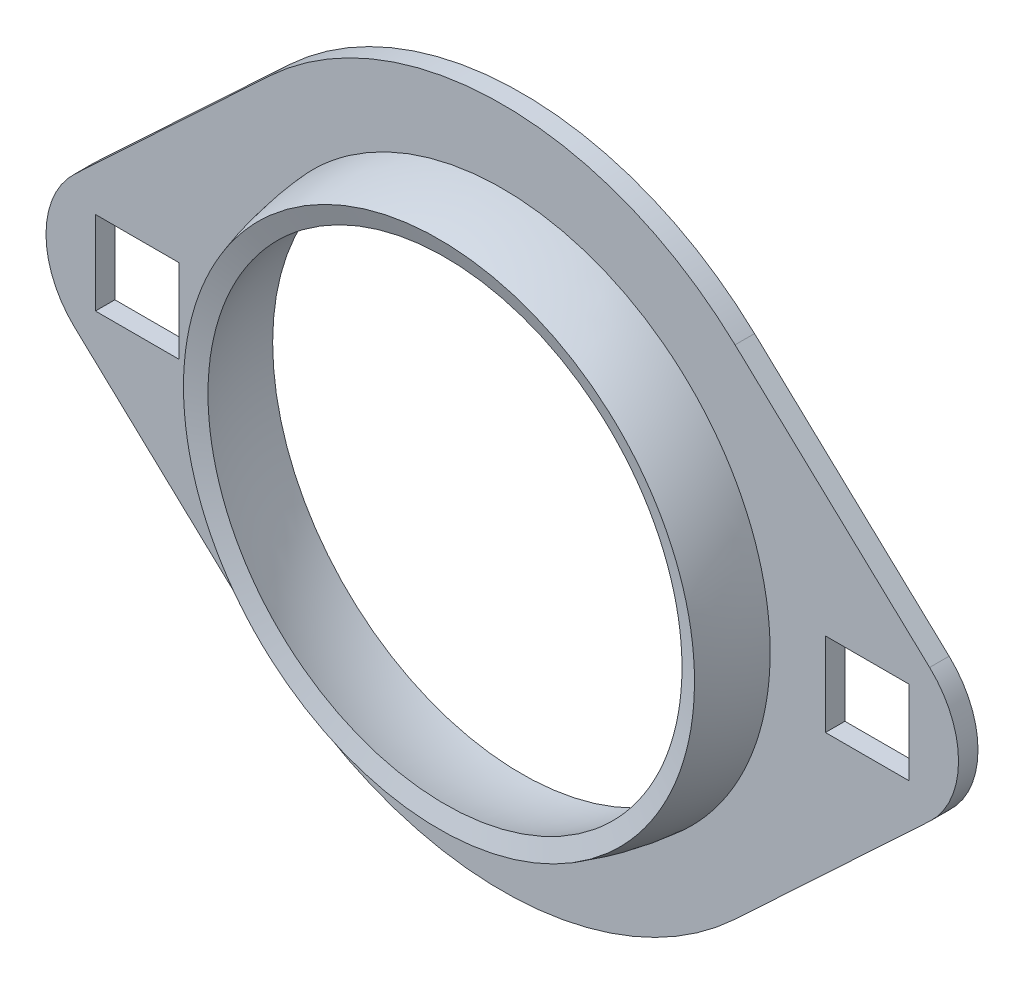
ISO-10303-21;
HEADER;
FILE_DESCRIPTION(('STEP AP214'),'2;1');
FILE_NAME('part.step','',(''),(''),'','','');
FILE_SCHEMA(('AUTOMOTIVE_DESIGN { 1 0 10303 214 1 1 1 1 }'));
ENDSEC;
DATA;
#1=APPLICATION_CONTEXT('core data for automotive mechanical design processes');
#2=APPLICATION_PROTOCOL_DEFINITION('international standard','automotive_design',2000,#1);
#3=PRODUCT_CONTEXT('',#1,'mechanical');
#4=PRODUCT('Part','Part','',(#3));
#5=PRODUCT_RELATED_PRODUCT_CATEGORY('part','',(#4));
#6=PRODUCT_DEFINITION_FORMATION('','',#4);
#7=PRODUCT_DEFINITION_CONTEXT('part definition',#1,'design');
#8=PRODUCT_DEFINITION('design','',#6,#7);
#9=PRODUCT_DEFINITION_SHAPE('','',#8);
#10=(LENGTH_UNIT() NAMED_UNIT(*) SI_UNIT(.MILLI.,.METRE.));
#11=(NAMED_UNIT(*) PLANE_ANGLE_UNIT() SI_UNIT($,.RADIAN.));
#12=(NAMED_UNIT(*) SI_UNIT($,.STERADIAN.) SOLID_ANGLE_UNIT());
#13=UNCERTAINTY_MEASURE_WITH_UNIT(LENGTH_MEASURE(1.E-05),#10,'distance_accuracy_value','');
#14=(GEOMETRIC_REPRESENTATION_CONTEXT(3) GLOBAL_UNCERTAINTY_ASSIGNED_CONTEXT((#13)) GLOBAL_UNIT_ASSIGNED_CONTEXT((#10,
#11,#12)) REPRESENTATION_CONTEXT('',''));
#15=CARTESIAN_POINT('',(0.,0.,0.));
#16=DIRECTION('',(0.,0.,1.));
#17=DIRECTION('',(1.,0.,0.));
#18=AXIS2_PLACEMENT_3D('',#15,#16,#17);
#19=CARTESIAN_POINT('',(0.,0.,0.));
#20=DIRECTION('',(1.,0.,0.));
#21=DIRECTION('',(0.,1.,0.));
#22=AXIS2_PLACEMENT_3D('',#19,#20,#21);
#23=SPHERICAL_SURFACE('',#22,28.032);
#24=CARTESIAN_POINT('',(-27.9582545950208,0.,2.03200000000001));
#25=CARTESIAN_POINT('',(-27.958252331193,0.680182055472307,2.03200000000001));
#26=CARTESIAN_POINT('',(-27.9334185683645,1.36042712634298,2.032));
#27=CARTESIAN_POINT('',(-27.8341925101078,2.71750797823654,2.032));
#28=CARTESIAN_POINT('',(-27.7597821350271,3.39434242470842,2.032));
#29=CARTESIAN_POINT('',(-27.5607902216159,4.74754433870443,2.032));
#30=CARTESIAN_POINT('',(-27.4357130096459,5.4238390488282,2.032));
#31=CARTESIAN_POINT('',(-27.13602700155,6.76554945846446,2.032));
#32=CARTESIAN_POINT('',(-26.9614052572961,7.4309622659218,2.032));
#33=CARTESIAN_POINT('',(-26.563346580858,8.74794194822464,2.032));
#34=CARTESIAN_POINT('',(-26.3398472163877,9.39948993451674,2.032));
#35=CARTESIAN_POINT('',(-25.8453385008513,10.6843939440971,2.032));
#36=CARTESIAN_POINT('',(-25.5743271307147,11.3177491929349,2.032));
#37=CARTESIAN_POINT('',(-25.1125123878,12.295538954752,2.032));
#38=CARTESIAN_POINT('',(-24.9371758249838,12.6473590727802,2.032));
#39=CARTESIAN_POINT('',(-24.5718706128582,13.3432223138298,2.032));
#40=CARTESIAN_POINT('',(-24.3819048747235,13.6872669666168,2.032));
#41=CARTESIAN_POINT('',(-23.7904258771436,14.7070403321417,2.032));
#42=CARTESIAN_POINT('',(-23.3673265732286,15.3704174716313,2.032));
#43=CARTESIAN_POINT('',(-22.4667878061652,16.6590995257827,2.032));
#44=CARTESIAN_POINT('',(-21.989346790472,17.2844033519046,2.032));
#45=CARTESIAN_POINT('',(-20.9834818620275,18.4925724510988,2.032));
#46=CARTESIAN_POINT('',(-20.4550593573339,19.0754388954696,2.032));
#47=CARTESIAN_POINT('',(-19.3510018760383,20.194568604964,2.032));
#48=CARTESIAN_POINT('',(-18.7753676018932,20.7308325632346,2.032));
#49=CARTESIAN_POINT('',(-17.5809638767955,21.7529662477435,2.032));
#50=CARTESIAN_POINT('',(-16.9621941394752,22.2388356393694,2.032));
#51=CARTESIAN_POINT('',(-15.6859371680936,23.1567095401246,2.032));
#52=CARTESIAN_POINT('',(-15.0284507772519,23.5887152217268,2.032));
#53=CARTESIAN_POINT('',(-13.6794232593485,24.3958027845922,2.032));
#54=CARTESIAN_POINT('',(-12.9878821850403,24.7708847540311,2.032));
#55=CARTESIAN_POINT('',(-11.5756552263939,25.4614616956135,2.032));
#56=CARTESIAN_POINT('',(-10.8549691128082,25.7769561989465,2.032));
#57=CARTESIAN_POINT('',(-9.38958052212397,26.3461117276332,2.032));
#58=CARTESIAN_POINT('',(-8.64487803666707,26.5997727314671,2.032));
#59=CARTESIAN_POINT('',(-7.13674787364124,27.0434587488147,2.032));
#60=CARTESIAN_POINT('',(-6.37332011084736,27.2334834726407,2.032));
#61=CARTESIAN_POINT('',(-4.83317024910259,27.548544363251,2.032));
#62=CARTESIAN_POINT('',(-4.05644815103736,27.6735805343648,2.032));
#63=CARTESIAN_POINT('',(-2.4952330573971,27.8577752328326,2.032));
#64=CARTESIAN_POINT('',(-1.71074007608846,27.9169338811072,2.032));
#65=CARTESIAN_POINT('',(-0.139559083395231,27.968953362637,2.032));
#66=CARTESIAN_POINT('',(0.647128928008367,27.9618141953182,2.032));
#67=CARTESIAN_POINT('',(2.21710632729636,27.881288838288,2.032));
#68=CARTESIAN_POINT('',(3.0003957184686,27.8079027126788,2.032));
#69=CARTESIAN_POINT('',(4.55800793071663,27.5954052596441,2.032));
#70=CARTESIAN_POINT('',(5.33233075180186,27.456293932288,2.032));
#71=CARTESIAN_POINT('',(6.86650521023924,27.113334994169,2.032));
#72=CARTESIAN_POINT('',(7.6263568409619,26.9094873537501,2.032));
#73=CARTESIAN_POINT('',(9.12618646427876,26.4385050433974,2.032));
#74=CARTESIAN_POINT('',(9.8661644568677,26.1713703734469,2.032));
#75=CARTESIAN_POINT('',(11.3209860389779,25.5757131567986,2.032));
#76=CARTESIAN_POINT('',(12.0358296272851,25.2471906071357,2.032));
#77=CARTESIAN_POINT('',(13.4353002534133,24.5310932383392,2.032));
#78=CARTESIAN_POINT('',(14.1199272912361,24.1435184192089,2.032));
#79=CARTESIAN_POINT('',(15.4540973915761,23.3120720213326,2.032));
#80=CARTESIAN_POINT('',(16.1036404612665,22.868200454097,2.032));
#81=CARTESIAN_POINT('',(17.3630249158375,21.9273161579147,2.032));
#82=CARTESIAN_POINT('',(17.9728663007207,21.4303034289715,2.032));
#83=CARTESIAN_POINT('',(19.1485119922824,20.386670082362,2.032));
#84=CARTESIAN_POINT('',(19.7143162830944,19.8400494468222,2.032));
#85=CARTESIAN_POINT('',(20.79786501225,18.7010865859055,2.032));
#86=CARTESIAN_POINT('',(21.3156094505583,18.1087443604951,2.032));
#87=CARTESIAN_POINT('',(22.2993577748703,16.8825493270035,2.032));
#88=CARTESIAN_POINT('',(22.765361644613,16.2486965058765,2.032));
#89=CARTESIAN_POINT('',(23.6423156328547,14.9439867661744,2.032));
#90=CARTESIAN_POINT('',(24.0532657513805,14.2731298476173,2.032));
#91=CARTESIAN_POINT('',(24.8171902473135,12.899181988135,2.032));
#92=CARTESIAN_POINT('',(25.1701646820331,12.1960910790758,2.032));
#93=CARTESIAN_POINT('',(25.8156288686723,10.7626731734906,2.032));
#94=CARTESIAN_POINT('',(26.1081186206675,10.0323461769987,2.032));
#95=CARTESIAN_POINT('',(26.6305339199583,8.54964855443802,2.032));
#96=CARTESIAN_POINT('',(26.860459490552,7.79727793657817,2.032));
#97=CARTESIAN_POINT('',(27.2561119412073,6.27584170589516,2.032));
#98=CARTESIAN_POINT('',(27.4218388211978,5.50677609305351,2.032));
#99=CARTESIAN_POINT('',(27.6879159039949,3.95741611492121,2.032));
#100=CARTESIAN_POINT('',(27.7882659934673,3.17712173016729,2.032));
#101=CARTESIAN_POINT('',(27.9228756074547,1.61085294834626,2.032));
#102=CARTESIAN_POINT('',(27.9571351319368,0.824878551276318,2.032));
#103=CARTESIAN_POINT('',(27.9593200490487,-0.747161160408127,2.032));
#104=CARTESIAN_POINT('',(27.9272455494152,-1.5332264748729,2.032));
#105=CARTESIAN_POINT('',(27.7969906660873,-3.09986085421447,2.032));
#106=CARTESIAN_POINT('',(27.6988102823404,-3.88042991908692,2.032));
#107=CARTESIAN_POINT('',(27.4370414333297,-5.430523609161,2.032));
#108=CARTESIAN_POINT('',(27.2734528686066,-6.20004821756664,2.032));
#109=CARTESIAN_POINT('',(26.882030681245,-7.72258089771999,2.032));
#110=CARTESIAN_POINT('',(26.6541970596767,-8.47558896974277,2.032));
#111=CARTESIAN_POINT('',(26.1359002263523,-9.9597474397663,2.032));
#112=CARTESIAN_POINT('',(25.8454359782243,-10.6908974758461,2.032));
#113=CARTESIAN_POINT('',(25.2039451473927,-12.1261287697356,2.032));
#114=CARTESIAN_POINT('',(24.8529185540644,-12.8302100227964,2.032));
#115=CARTESIAN_POINT('',(24.0928118403075,-14.2062741456502,2.032));
#116=CARTESIAN_POINT('',(23.6837337174281,-14.8782581188455,2.032));
#117=CARTESIAN_POINT('',(22.8104234384964,-16.1853757696787,2.032));
#118=CARTESIAN_POINT('',(22.3461913325552,-16.8205094807969,2.032));
#119=CARTESIAN_POINT('',(21.3659201017934,-18.0493530649139,2.032));
#120=CARTESIAN_POINT('',(20.8498859454354,-18.6430669013546,2.032));
#121=CARTESIAN_POINT('',(19.7696395751779,-19.7849195991156,2.032));
#122=CARTESIAN_POINT('',(19.2054271919762,-20.3330583002679,2.032));
#123=CARTESIAN_POINT('',(18.0327015821395,-21.3799824116902,2.032));
#124=CARTESIAN_POINT('',(17.4241782324712,-21.8787564826078,2.032));
#125=CARTESIAN_POINT('',(16.1672816676195,-22.8232549014534,2.032));
#126=CARTESIAN_POINT('',(15.5189090187674,-23.2689800030399,2.032));
#127=CARTESIAN_POINT('',(14.1866407740451,-24.1043913315386,2.032));
#128=CARTESIAN_POINT('',(13.5027306792561,-24.4940544374604,2.032));
#129=CARTESIAN_POINT('',(12.1044636613552,-25.2143713876202,2.032));
#130=CARTESIAN_POINT('',(11.3901049185677,-25.5450216989863,2.032));
#131=CARTESIAN_POINT('',(9.93677156557457,-26.1446323946662,2.032));
#132=CARTESIAN_POINT('',(9.19782235843572,-26.4136543089238,2.032));
#133=CARTESIAN_POINT('',(7.70013673322675,-26.8884561415647,2.032));
#134=CARTESIAN_POINT('',(6.9414050525598,-27.0942510530235,2.032));
#135=CARTESIAN_POINT('',(5.16323756808436,-27.496928500977,2.032));
#136=CARTESIAN_POINT('',(4.13826504159324,-27.6697642736385,2.032));
#137=CARTESIAN_POINT('',(2.07545908637679,-27.9004222698613,2.032));
#138=CARTESIAN_POINT('',(1.03762565318401,-27.9582444534695,2.032));
#139=CARTESIAN_POINT('',(-0.78556561954578,-27.9582622729863,2.032));
#140=CARTESIAN_POINT('',(-1.5710121458007,-27.9251338163394,2.032));
#141=CARTESIAN_POINT('',(-3.13657780522743,-27.7928578631222,2.032));
#142=CARTESIAN_POINT('',(-3.91669562956628,-27.6936946973161,2.032));
#143=CARTESIAN_POINT('',(-5.46657341533034,-27.429896104831,2.032));
#144=CARTESIAN_POINT('',(-6.23632216315119,-27.265194891049,2.032));
#145=CARTESIAN_POINT('',(-7.75915633432398,-26.8715078311531,2.032));
#146=CARTESIAN_POINT('',(-8.51224275240914,-26.6425258338037,2.032));
#147=CARTESIAN_POINT('',(-9.99613978841402,-26.1220055846871,2.032));
#148=CARTESIAN_POINT('',(-10.7269591316045,-25.8304922052065,2.032));
#149=CARTESIAN_POINT('',(-12.1614494214317,-25.1869239770096,2.032));
#150=CARTESIAN_POINT('',(-12.8651199771923,-24.8348682570298,2.032));
#151=CARTESIAN_POINT('',(-14.2401183762122,-24.0728208506321,2.032));
#152=CARTESIAN_POINT('',(-14.9114545663888,-23.6628442247928,2.032));
#153=CARTESIAN_POINT('',(-16.2172052388053,-22.7878020433979,2.032));
#154=CARTESIAN_POINT('',(-16.8516198859259,-22.3227367338803,2.032));
#155=CARTESIAN_POINT('',(-18.0790349108542,-21.3408104819436,2.032));
#156=CARTESIAN_POINT('',(-18.6720343836026,-20.8239484081937,2.032));
#157=CARTESIAN_POINT('',(-19.8123915638546,-19.7421083325689,2.032));
#158=CARTESIAN_POINT('',(-20.3597490547591,-19.1771301023793,2.032));
#159=CARTESIAN_POINT('',(-21.4050416843927,-18.0029486301589,2.032));
#160=CARTESIAN_POINT('',(-21.9029661089485,-17.3937358500105,2.032));
#161=CARTESIAN_POINT('',(-22.84570977296,-16.1355350459731,2.032));
#162=CARTESIAN_POINT('',(-23.2905298590389,-15.4865476564458,2.032));
#163=CARTESIAN_POINT('',(-24.124024853032,-14.1532229483856,2.032));
#164=CARTESIAN_POINT('',(-24.5126843749028,-13.4688760120151,2.032));
#165=CARTESIAN_POINT('',(-25.2309729488576,-12.0698114259768,2.032));
#166=CARTESIAN_POINT('',(-25.560598110521,-11.3550917785559,2.032));
#167=CARTESIAN_POINT('',(-26.1582247712951,-9.90095112652665,2.032));
#168=CARTESIAN_POINT('',(-26.4262698364212,-9.16154801150094,2.032));
#169=CARTESIAN_POINT('',(-26.8990842503542,-7.66291666510364,2.032));
#170=CARTESIAN_POINT('',(-27.1038701039862,-6.90369366105651,2.032));
#171=CARTESIAN_POINT('',(-27.3895902216678,-5.6338985046032,2.032));
#172=CARTESIAN_POINT('',(-27.4889113651703,-5.12738325625107,2.032));
#173=CARTESIAN_POINT('',(-27.6593685281045,-4.1096738962469,2.032));
#174=CARTESIAN_POINT('',(-27.7305084668248,-3.59848044533812,2.032));
#175=CARTESIAN_POINT('',(-27.8443291389592,-2.57350670503815,2.032));
#176=CARTESIAN_POINT('',(-27.8870410345069,-2.05972987225222,2.032));
#177=CARTESIAN_POINT('',(-27.9440038112567,-1.03064735833413,2.032));
#178=CARTESIAN_POINT('',(-27.958256310216,-0.515341765771167,2.03200000000001));
#179=CARTESIAN_POINT('',(-27.9582545950208,0.,2.03200000000001));
#180=B_SPLINE_CURVE_WITH_KNOTS('',3,(#24,#25,#26,#27,#28,#29,#30,#31,#32,#33,#34,#35,#36,#37,
#38,#39,#40,#41,#42,#43,#44,#45,#46,#47,#48,#49,#50,#51,#52,#53,#54,#55,#56,#57,#58,#59,#60,#61,
#62,#63,#64,#65,#66,#67,#68,#69,#70,#71,#72,#73,#74,#75,#76,#77,#78,#79,#80,#81,#82,#83,#84,#85,
#86,#87,#88,#89,#90,#91,#92,#93,#94,#95,#96,#97,#98,#99,#100,#101,#102,#103,#104,#105,#106,#107,
#108,#109,#110,#111,#112,#113,#114,#115,#116,#117,#118,#119,#120,#121,#122,#123,#124,#125,#126,
#127,#128,#129,#130,#131,#132,#133,#134,#135,#136,#137,#138,#139,#140,#141,#142,#143,#144,#145,
#146,#147,#148,#149,#150,#151,#152,#153,#154,#155,#156,#157,#158,#159,#160,#161,#162,#163,#164,
#165,#166,#167,#168,#169,#170,#171,#172,#173,#174,#175,#176,#177,#178,#179),.UNSPECIFIED.,.T.,
.F.,(4,2,2,2,2,2,2,2,2,2,2,2,2,2,2,2,2,2,2,2,2,2,2,2,2,2,2,2,2,2,2,2,2,2,2,2,2,2,2,2,2,2,2,2,2,
2,2,2,2,2,2,2,2,2,2,2,2,2,2,2,2,2,2,2,2,2,2,2,2,2,2,2,2,2,2,2,2,4),(0.,2.0402022646195,
4.08114895994354,6.14256394497329,8.20451816387265,10.2691217001761,12.3338129951569,
13.512767485759,14.6914879701987,17.0488991083379,19.4063776147185,21.7637910285283,
24.1211693730924,26.478563369298,28.8359060422035,31.1932450635096,33.5506026306459,
35.9079610182035,38.2653301368717,40.6226990984919,42.9800637330709,45.337428388061,
47.6947907620098,50.052153133474,52.4095165848548,54.7668800368586,57.1242436027249,
59.4816071684563,61.8389702522064,64.1963333358079,66.5536972687625,68.9110612034384,
71.2684258789804,73.6257905533795,75.9831528973721,78.3405152384206,80.6978767016157,
83.0552381674214,85.412603719825,87.769969273403,90.1273309982597,92.4846927249834,
94.8420580363133,97.1994233083844,99.5568275916357,101.914232288455,104.271555886799,
106.628877343367,108.985972919046,111.343076778088,113.700720827506,116.058331378238,
118.4169114804,120.775632734468,123.131988670992,125.487785410691,128.599468415369,
131.71115250097,134.066946258608,136.423299216821,138.782023473497,141.14060653341,
143.498253184574,145.855933767422,148.213002431231,150.570060568251,152.927170198719,
155.284291014475,157.641921604742,159.999514603138,162.357752280452,164.716145310736,
167.072864677188,169.428968636689,170.976735777219,172.524287587078,174.070140201838,
175.615904941029),.UNSPECIFIED.);
#181=CARTESIAN_POINT('',(-27.9582545950208,0.,2.03200000000001));
#182=VERTEX_POINT('',#181);
#183=EDGE_CURVE('E111',#182,#182,#180,.T.);
#184=ORIENTED_EDGE('',*,*,#183,.F.);
#185=EDGE_LOOP('',(#184));
#186=FACE_BOUND('',#185,.T.);
#187=CARTESIAN_POINT('',(0.,0.,8.63599999999999));
#188=DIRECTION('',(0.,0.,1.));
#189=DIRECTION('',(1.,0.,0.));
#190=AXIS2_PLACEMENT_3D('',#187,#188,#189);
#191=CIRCLE('',#190,26.668568165539);
#192=CARTESIAN_POINT('',(26.668568165539,0.,8.63599999999999));
#193=VERTEX_POINT('',#192);
#194=EDGE_CURVE('E21',#193,#193,#191,.F.);
#195=ORIENTED_EDGE('',*,*,#194,.T.);
#196=EDGE_LOOP('',(#195));
#197=FACE_BOUND('',#196,.T.);
#198=ADVANCED_FACE('F16',(#186,#197),#23,.T.);
#199=CARTESIAN_POINT('',(0.,0.,8.63599999999999));
#200=DIRECTION('',(0.,0.,1.));
#201=DIRECTION('',(1.,0.,0.));
#202=AXIS2_PLACEMENT_3D('',#199,#200,#201);
#203=CONICAL_SURFACE('',#202,26.668568165539,1.25762581388274);
#204=CARTESIAN_POINT('',(0.,0.,8.00998858447488));
#205=DIRECTION('',(0.,0.,1.));
#206=DIRECTION('',(1.,0.,0.));
#207=AXIS2_PLACEMENT_3D('',#204,#205,#206);
#208=CIRCLE('',#207,24.7354014092471);
#209=CARTESIAN_POINT('',(24.7354014092471,0.,8.00998858447488));
#210=VERTEX_POINT('',#209);
#211=EDGE_CURVE('E151',#210,#210,#208,.F.);
#212=ORIENTED_EDGE('',*,*,#211,.T.);
#213=EDGE_LOOP('',(#212));
#214=FACE_BOUND('',#213,.T.);
#215=ORIENTED_EDGE('',*,*,#194,.F.);
#216=EDGE_LOOP('',(#215));
#217=FACE_BOUND('',#216,.T.);
#218=ADVANCED_FACE('F168',(#214,#217),#203,.F.);
#219=CARTESIAN_POINT('',(0.,0.,2.032));
#220=DIRECTION('',(0.,0.,1.));
#221=DIRECTION('',(1.,0.,0.));
#222=AXIS2_PLACEMENT_3D('',#219,#220,#221);
#223=PLANE('',#222);
#224=DIRECTION('',(0.,1.,0.));
#225=VECTOR('',#224,1.);
#226=CARTESIAN_POINT('',(-42.4656250000004,6.12095415020164E-06,2.032));
#227=LINE('',#226,#225);
#228=CARTESIAN_POINT('',(-42.4656250000004,-4.36561887904585,2.032));
#229=VERTEX_POINT('',#228);
#230=CARTESIAN_POINT('',(-42.4656250000004,4.36563112095415,2.032));
#231=VERTEX_POINT('',#230);
#232=EDGE_CURVE('E270',#229,#231,#227,.T.);
#233=ORIENTED_EDGE('',*,*,#232,.T.);
#234=DIRECTION('',(1.,0.,0.));
#235=VECTOR('',#234,1.);
#236=CARTESIAN_POINT('',(-38.1000000000004,4.36563112095415,2.032));
#237=LINE('',#236,#235);
#238=CARTESIAN_POINT('',(-33.7343750000004,4.36563112095415,2.032));
#239=VERTEX_POINT('',#238);
#240=EDGE_CURVE('E264',#231,#239,#237,.T.);
#241=ORIENTED_EDGE('',*,*,#240,.T.);
#242=DIRECTION('',(0.,1.,0.));
#243=VECTOR('',#242,1.);
#244=CARTESIAN_POINT('',(-33.7343750000004,6.12095415075675E-06,2.032));
#245=LINE('',#244,#243);
#246=CARTESIAN_POINT('',(-33.7343750000004,-4.36561887904585,2.032));
#247=VERTEX_POINT('',#246);
#248=EDGE_CURVE('E258',#239,#247,#245,.F.);
#249=ORIENTED_EDGE('',*,*,#248,.T.);
#250=DIRECTION('',(1.,0.,0.));
#251=VECTOR('',#250,1.);
#252=CARTESIAN_POINT('',(-38.1000000000004,-4.36561887904585,2.032));
#253=LINE('',#252,#251);
#254=EDGE_CURVE('E276',#247,#229,#253,.F.);
#255=ORIENTED_EDGE('',*,*,#254,.T.);
#256=EDGE_LOOP('',(#233,#241,#249,#255));
#257=FACE_BOUND('',#256,.T.);
#258=DIRECTION('',(1.,0.,0.));
#259=VECTOR('',#258,1.);
#260=CARTESIAN_POINT('',(38.1000000000004,4.36562500000001,2.032));
#261=LINE('',#260,#259);
#262=CARTESIAN_POINT('',(33.7343750000004,4.36562500000001,2.032));
#263=VERTEX_POINT('',#262);
#264=CARTESIAN_POINT('',(42.4656250000004,4.36562500000001,2.032));
#265=VERTEX_POINT('',#264);
#266=EDGE_CURVE('E294',#263,#265,#261,.T.);
#267=ORIENTED_EDGE('',*,*,#266,.T.);
#268=DIRECTION('',(0.,1.,0.));
#269=VECTOR('',#268,1.);
#270=CARTESIAN_POINT('',(42.4656250000004,0.,2.032));
#271=LINE('',#270,#269);
#272=CARTESIAN_POINT('',(42.4656250000004,-4.36562499999999,2.032));
#273=VERTEX_POINT('',#272);
#274=EDGE_CURVE('E288',#265,#273,#271,.F.);
#275=ORIENTED_EDGE('',*,*,#274,.T.);
#276=DIRECTION('',(1.,0.,0.));
#277=VECTOR('',#276,1.);
#278=CARTESIAN_POINT('',(38.1000000000004,-4.36562499999999,2.032));
#279=LINE('',#278,#277);
#280=CARTESIAN_POINT('',(33.7343750000004,-4.36562499999999,2.032));
#281=VERTEX_POINT('',#280);
#282=EDGE_CURVE('E282',#273,#281,#279,.F.);
#283=ORIENTED_EDGE('',*,*,#282,.T.);
#284=DIRECTION('',(0.,-1.,0.));
#285=VECTOR('',#284,1.);
#286=CARTESIAN_POINT('',(33.7343750000004,0.,2.032));
#287=LINE('',#286,#285);
#288=EDGE_CURVE('E154',#281,#263,#287,.F.);
#289=ORIENTED_EDGE('',*,*,#288,.T.);
#290=EDGE_LOOP('',(#267,#275,#283,#289));
#291=FACE_BOUND('',#290,.T.);
#292=ORIENTED_EDGE('',*,*,#183,.T.);
#293=EDGE_LOOP('',(#292));
#294=FACE_BOUND('',#293,.T.);
#295=CARTESIAN_POINT('',(38.1000000000004,0.,2.032));
#296=DIRECTION('',(0.,0.,1.));
#297=DIRECTION('',(1.,0.,0.));
#298=AXIS2_PLACEMENT_3D('',#295,#296,#297);
#299=CIRCLE('',#298,9.52500193830264);
#300=CARTESIAN_POINT('',(44.6087508399314,6.95426663483413,2.032));
#301=VERTEX_POINT('',#300);
#302=CARTESIAN_POINT('',(44.6087508399314,-6.9542666348341,2.032));
#303=VERTEX_POINT('',#302);
#304=EDGE_CURVE('E128',#301,#303,#299,.F.);
#305=ORIENTED_EDGE('',*,*,#304,.F.);
#306=DIRECTION('',(0.730106584741899,-0.68333328245924,0.));
#307=VECTOR('',#306,1.);
#308=CARTESIAN_POINT('',(34.454041182091,16.458428394128,2.032));
#309=LINE('',#308,#307);
#310=CARTESIAN_POINT('',(24.2993315242506,25.9625901534219,2.032));
#311=VERTEX_POINT('',#310);
#312=EDGE_CURVE('E121',#301,#311,#309,.F.);
#313=ORIENTED_EDGE('',*,*,#312,.T.);
#314=CARTESIAN_POINT('',(0.,0.,2.032));
#315=DIRECTION('',(0.,0.,1.));
#316=DIRECTION('',(1.,0.,0.));
#317=AXIS2_PLACEMENT_3D('',#314,#315,#316);
#318=CIRCLE('',#317,35.56);
#319=CARTESIAN_POINT('',(-24.2993315242506,25.9625901534219,2.032));
#320=VERTEX_POINT('',#319);
#321=EDGE_CURVE('E107',#320,#311,#318,.F.);
#322=ORIENTED_EDGE('',*,*,#321,.F.);
#323=DIRECTION('',(0.730106584741899,0.68333328245924,0.));
#324=VECTOR('',#323,1.);
#325=CARTESIAN_POINT('',(-34.454041182091,16.458428394128,2.032));
#326=LINE('',#325,#324);
#327=CARTESIAN_POINT('',(-44.6087508399314,6.95426663483412,2.032));
#328=VERTEX_POINT('',#327);
#329=EDGE_CURVE('E102',#320,#328,#326,.F.);
#330=ORIENTED_EDGE('',*,*,#329,.T.);
#331=CARTESIAN_POINT('',(-38.1000000000004,0.,2.032));
#332=DIRECTION('',(0.,0.,1.));
#333=DIRECTION('',(1.,0.,0.));
#334=AXIS2_PLACEMENT_3D('',#331,#332,#333);
#335=CIRCLE('',#334,9.52500193830265);
#336=CARTESIAN_POINT('',(-44.6087515475167,-6.95426597257933,2.032));
#337=VERTEX_POINT('',#336);
#338=EDGE_CURVE('E92',#337,#328,#335,.F.);
#339=ORIENTED_EDGE('',*,*,#338,.F.);
#340=DIRECTION('',(-0.730106584741899,0.683333282459241,0.));
#341=VECTOR('',#340,1.);
#342=CARTESIAN_POINT('',(-34.4540411820923,-16.4584283941268,2.032));
#343=LINE('',#342,#341);
#344=CARTESIAN_POINT('',(-24.2993315242506,-25.9625901534219,2.032));
#345=VERTEX_POINT('',#344);
#346=EDGE_CURVE('E117',#337,#345,#343,.F.);
#347=ORIENTED_EDGE('',*,*,#346,.T.);
#348=CARTESIAN_POINT('',(0.,0.,2.032));
#349=DIRECTION('',(0.,0.,1.));
#350=DIRECTION('',(1.,0.,0.));
#351=AXIS2_PLACEMENT_3D('',#348,#349,#350);
#352=CIRCLE('',#351,35.56);
#353=CARTESIAN_POINT('',(24.2993315242506,-25.9625901534219,2.032));
#354=VERTEX_POINT('',#353);
#355=EDGE_CURVE('E130',#354,#345,#352,.F.);
#356=ORIENTED_EDGE('',*,*,#355,.F.);
#357=DIRECTION('',(-0.730106584741899,-0.683333282459241,0.));
#358=VECTOR('',#357,1.);
#359=CARTESIAN_POINT('',(34.454041182091,-16.458428394128,2.032));
#360=LINE('',#359,#358);
#361=EDGE_CURVE('E125',#354,#303,#360,.F.);
#362=ORIENTED_EDGE('',*,*,#361,.T.);
#363=EDGE_LOOP('',(#305,#313,#322,#330,#339,#347,#356,#362));
#364=FACE_BOUND('',#363,.T.);
#365=ADVANCED_FACE('F105',(#257,#291,#294,#364),#223,.T.);
#366=CARTESIAN_POINT('',(-34.454041182091,16.458428394128,0.));
#367=DIRECTION('',(0.68333328245924,-0.730106584741899,0.));
#368=DIRECTION('',(0.730106584741899,0.68333328245924,0.));
#369=AXIS2_PLACEMENT_3D('',#366,#367,#368);
#370=PLANE('',#369);
#371=DIRECTION('',(0.,0.,1.));
#372=VECTOR('',#371,1.);
#373=CARTESIAN_POINT('',(-44.6087508399314,6.95426663483411,0.));
#374=LINE('',#373,#372);
#375=CARTESIAN_POINT('',(-44.6087508399314,6.95426663483413,0.));
#376=VERTEX_POINT('',#375);
#377=EDGE_CURVE('E99',#328,#376,#374,.F.);
#378=ORIENTED_EDGE('',*,*,#377,.F.);
#379=ORIENTED_EDGE('',*,*,#329,.F.);
#380=DIRECTION('',(0.,0.,1.));
#381=VECTOR('',#380,1.);
#382=CARTESIAN_POINT('',(-24.2993315242506,25.9625901534219,0.));
#383=LINE('',#382,#381);
#384=CARTESIAN_POINT('',(-24.2993315242506,25.9625901534219,0.));
#385=VERTEX_POINT('',#384);
#386=EDGE_CURVE('E122',#385,#320,#383,.T.);
#387=ORIENTED_EDGE('',*,*,#386,.F.);
#388=DIRECTION('',(-0.7301065847419,-0.68333328245924,0.));
#389=VECTOR('',#388,1.);
#390=CARTESIAN_POINT('',(-24.2993315242506,25.9625901534219,0.));
#391=LINE('',#390,#389);
#392=EDGE_CURVE('E115',#385,#376,#391,.T.);
#393=ORIENTED_EDGE('',*,*,#392,.T.);
#394=EDGE_LOOP('',(#378,#379,#387,#393));
#395=FACE_BOUND('',#394,.T.);
#396=ADVANCED_FACE('F114',(#395),#370,.F.);
#397=CARTESIAN_POINT('',(-38.1000000000004,0.,0.));
#398=DIRECTION('',(0.,0.,1.));
#399=DIRECTION('',(1.,0.,0.));
#400=AXIS2_PLACEMENT_3D('',#397,#398,#399);
#401=CYLINDRICAL_SURFACE('',#400,9.52500193830265);
#402=ORIENTED_EDGE('',*,*,#338,.T.);
#403=ORIENTED_EDGE('',*,*,#377,.T.);
#404=CARTESIAN_POINT('',(-38.1000000000004,0.,0.));
#405=DIRECTION('',(0.,0.,1.));
#406=DIRECTION('',(1.,0.,0.));
#407=AXIS2_PLACEMENT_3D('',#404,#405,#406);
#408=CIRCLE('',#407,9.52500193830265);
#409=CARTESIAN_POINT('',(-44.6087515475166,-6.95426597257919,0.));
#410=VERTEX_POINT('',#409);
#411=EDGE_CURVE('E149',#376,#410,#408,.T.);
#412=ORIENTED_EDGE('',*,*,#411,.T.);
#413=DIRECTION('',(0.,0.,1.));
#414=VECTOR('',#413,1.);
#415=CARTESIAN_POINT('',(-44.608752255102,-6.95426531032456,0.));
#416=LINE('',#415,#414);
#417=EDGE_CURVE('E101',#410,#337,#416,.T.);
#418=ORIENTED_EDGE('',*,*,#417,.T.);
#419=EDGE_LOOP('',(#402,#403,#412,#418));
#420=FACE_BOUND('',#419,.T.);
#421=ADVANCED_FACE('F96',(#420),#401,.T.);
#422=CARTESIAN_POINT('',(-34.4540411820923,-16.4584283941268,0.));
#423=DIRECTION('',(0.683333282459241,0.730106584741899,0.));
#424=DIRECTION('',(-0.730106584741899,0.683333282459241,0.));
#425=AXIS2_PLACEMENT_3D('',#422,#423,#424);
#426=PLANE('',#425);
#427=DIRECTION('',(0.,0.,1.));
#428=VECTOR('',#427,1.);
#429=CARTESIAN_POINT('',(-24.2993315242506,-25.9625901534219,0.));
#430=LINE('',#429,#428);
#431=CARTESIAN_POINT('',(-24.2993315242507,-25.9625901534218,0.));
#432=VERTEX_POINT('',#431);
#433=EDGE_CURVE('E159',#345,#432,#430,.F.);
#434=ORIENTED_EDGE('',*,*,#433,.F.);
#435=ORIENTED_EDGE('',*,*,#346,.F.);
#436=ORIENTED_EDGE('',*,*,#417,.F.);
#437=DIRECTION('',(0.730106584741894,-0.683333282459246,0.));
#438=VECTOR('',#437,1.);
#439=CARTESIAN_POINT('',(-44.6087522551018,-6.95426531032439,0.));
#440=LINE('',#439,#438);
#441=EDGE_CURVE('E148',#410,#432,#440,.T.);
#442=ORIENTED_EDGE('',*,*,#441,.T.);
#443=EDGE_LOOP('',(#434,#435,#436,#442));
#444=FACE_BOUND('',#443,.T.);
#445=ADVANCED_FACE('F249',(#444),#426,.F.);
#446=CARTESIAN_POINT('',(0.,0.,0.));
#447=DIRECTION('',(0.,0.,1.));
#448=DIRECTION('',(1.,0.,0.));
#449=AXIS2_PLACEMENT_3D('',#446,#447,#448);
#450=CYLINDRICAL_SURFACE('',#449,35.56);
#451=ORIENTED_EDGE('',*,*,#355,.T.);
#452=ORIENTED_EDGE('',*,*,#433,.T.);
#453=CARTESIAN_POINT('',(0.,0.,0.));
#454=DIRECTION('',(0.,0.,1.));
#455=DIRECTION('',(1.,0.,0.));
#456=AXIS2_PLACEMENT_3D('',#453,#454,#455);
#457=CIRCLE('',#456,35.56);
#458=CARTESIAN_POINT('',(24.2993315242506,-25.9625901534219,0.));
#459=VERTEX_POINT('',#458);
#460=EDGE_CURVE('E145',#432,#459,#457,.T.);
#461=ORIENTED_EDGE('',*,*,#460,.T.);
#462=DIRECTION('',(0.,0.,1.));
#463=VECTOR('',#462,1.);
#464=CARTESIAN_POINT('',(24.2993315242506,-25.9625901534219,0.));
#465=LINE('',#464,#463);
#466=EDGE_CURVE('E129',#459,#354,#465,.T.);
#467=ORIENTED_EDGE('',*,*,#466,.T.);
#468=EDGE_LOOP('',(#451,#452,#461,#467));
#469=FACE_BOUND('',#468,.T.);
#470=ADVANCED_FACE('F240',(#469),#450,.T.);
#471=CARTESIAN_POINT('',(34.454041182091,-16.458428394128,0.));
#472=DIRECTION('',(-0.683333282459241,0.730106584741899,0.));
#473=DIRECTION('',(-0.730106584741899,-0.683333282459241,0.));
#474=AXIS2_PLACEMENT_3D('',#471,#472,#473);
#475=PLANE('',#474);
#476=DIRECTION('',(0.,0.,1.));
#477=VECTOR('',#476,1.);
#478=CARTESIAN_POINT('',(44.6087508399314,-6.95426663483409,0.));
#479=LINE('',#478,#477);
#480=CARTESIAN_POINT('',(44.6087508399314,-6.9542666348341,0.));
#481=VERTEX_POINT('',#480);
#482=EDGE_CURVE('E158',#303,#481,#479,.F.);
#483=ORIENTED_EDGE('',*,*,#482,.F.);
#484=ORIENTED_EDGE('',*,*,#361,.F.);
#485=ORIENTED_EDGE('',*,*,#466,.F.);
#486=DIRECTION('',(0.730106584741899,0.68333328245924,0.));
#487=VECTOR('',#486,1.);
#488=CARTESIAN_POINT('',(24.2993315242506,-25.9625901534219,0.));
#489=LINE('',#488,#487);
#490=EDGE_CURVE('E144',#459,#481,#489,.T.);
#491=ORIENTED_EDGE('',*,*,#490,.T.);
#492=EDGE_LOOP('',(#483,#484,#485,#491));
#493=FACE_BOUND('',#492,.T.);
#494=ADVANCED_FACE('F343',(#493),#475,.F.);
#495=CARTESIAN_POINT('',(38.1000000000004,0.,0.));
#496=DIRECTION('',(0.,0.,1.));
#497=DIRECTION('',(1.,0.,0.));
#498=AXIS2_PLACEMENT_3D('',#495,#496,#497);
#499=CYLINDRICAL_SURFACE('',#498,9.52500193830264);
#500=ORIENTED_EDGE('',*,*,#304,.T.);
#501=ORIENTED_EDGE('',*,*,#482,.T.);
#502=CARTESIAN_POINT('',(38.1000000000004,0.,0.));
#503=DIRECTION('',(0.,0.,1.));
#504=DIRECTION('',(1.,0.,0.));
#505=AXIS2_PLACEMENT_3D('',#502,#503,#504);
#506=CIRCLE('',#505,9.52500193830264);
#507=CARTESIAN_POINT('',(44.6087506299486,6.95426616765917,0.));
#508=VERTEX_POINT('',#507);
#509=EDGE_CURVE('E141',#481,#508,#506,.T.);
#510=ORIENTED_EDGE('',*,*,#509,.T.);
#511=DIRECTION('',(0.,0.,1.));
#512=VECTOR('',#511,1.);
#513=CARTESIAN_POINT('',(44.6087508399314,6.95426663483414,0.));
#514=LINE('',#513,#512);
#515=EDGE_CURVE('E123',#508,#301,#514,.T.);
#516=ORIENTED_EDGE('',*,*,#515,.T.);
#517=EDGE_LOOP('',(#500,#501,#510,#516));
#518=FACE_BOUND('',#517,.T.);
#519=ADVANCED_FACE('F339',(#518),#499,.T.);
#520=CARTESIAN_POINT('',(34.454041182091,16.458428394128,0.));
#521=DIRECTION('',(-0.68333328245924,-0.730106584741899,0.));
#522=DIRECTION('',(0.730106584741899,-0.68333328245924,0.));
#523=AXIS2_PLACEMENT_3D('',#520,#521,#522);
#524=PLANE('',#523);
#525=DIRECTION('',(0.,0.,1.));
#526=VECTOR('',#525,1.);
#527=CARTESIAN_POINT('',(24.2993315242506,25.9625901534219,0.));
#528=LINE('',#527,#526);
#529=CARTESIAN_POINT('',(24.2993319765213,25.9625897301253,0.));
#530=VERTEX_POINT('',#529);
#531=EDGE_CURVE('E155',#311,#530,#528,.F.);
#532=ORIENTED_EDGE('',*,*,#531,.F.);
#533=ORIENTED_EDGE('',*,*,#312,.F.);
#534=ORIENTED_EDGE('',*,*,#515,.F.);
#535=DIRECTION('',(-0.730106560934442,0.683333307896287,0.));
#536=VECTOR('',#535,1.);
#537=CARTESIAN_POINT('',(44.6087501776779,6.95426592725026,0.));
#538=LINE('',#537,#536);
#539=EDGE_CURVE('E140',#508,#530,#538,.T.);
#540=ORIENTED_EDGE('',*,*,#539,.T.);
#541=EDGE_LOOP('',(#532,#533,#534,#540));
#542=FACE_BOUND('',#541,.T.);
#543=ADVANCED_FACE('F335',(#542),#524,.F.);
#544=CARTESIAN_POINT('',(0.,0.,0.));
#545=DIRECTION('',(0.,0.,1.));
#546=DIRECTION('',(1.,0.,0.));
#547=AXIS2_PLACEMENT_3D('',#544,#545,#546);
#548=CYLINDRICAL_SURFACE('',#547,35.56);
#549=ORIENTED_EDGE('',*,*,#321,.T.);
#550=ORIENTED_EDGE('',*,*,#531,.T.);
#551=CARTESIAN_POINT('',(0.,0.,0.));
#552=DIRECTION('',(0.,0.,1.));
#553=DIRECTION('',(1.,0.,0.));
#554=AXIS2_PLACEMENT_3D('',#551,#552,#553);
#555=CIRCLE('',#554,35.56);
#556=EDGE_CURVE('E137',#530,#385,#555,.T.);
#557=ORIENTED_EDGE('',*,*,#556,.T.);
#558=ORIENTED_EDGE('',*,*,#386,.T.);
#559=EDGE_LOOP('',(#549,#550,#557,#558));
#560=FACE_BOUND('',#559,.T.);
#561=ADVANCED_FACE('F224',(#560),#548,.T.);
#562=CARTESIAN_POINT('',(0.,0.,0.));
#563=DIRECTION('',(1.,0.,0.));
#564=DIRECTION('',(0.,1.,0.));
#565=AXIS2_PLACEMENT_3D('',#562,#563,#564);
#566=SPHERICAL_SURFACE('',#565,26.);
#567=ORIENTED_EDGE('',*,*,#211,.F.);
#568=EDGE_LOOP('',(#567));
#569=FACE_BOUND('',#568,.T.);
#570=CARTESIAN_POINT('',(0.,0.,0.));
#571=DIRECTION('',(0.,0.,1.));
#572=DIRECTION('',(1.,0.,0.));
#573=AXIS2_PLACEMENT_3D('',#570,#571,#572);
#574=CIRCLE('',#573,26.);
#575=CARTESIAN_POINT('',(26.,0.,0.));
#576=VERTEX_POINT('',#575);
#577=CARTESIAN_POINT('',(-26.,0.,0.));
#578=VERTEX_POINT('',#577);
#579=EDGE_CURVE('E35',#576,#578,#574,.F.);
#580=ORIENTED_EDGE('',*,*,#579,.T.);
#581=CARTESIAN_POINT('',(0.,0.,0.));
#582=DIRECTION('',(0.,0.,-1.));
#583=DIRECTION('',(1.,0.,0.));
#584=AXIS2_PLACEMENT_3D('',#581,#582,#583);
#585=CIRCLE('',#584,26.);
#586=EDGE_CURVE('E135',#578,#576,#585,.T.);
#587=ORIENTED_EDGE('',*,*,#586,.T.);
#588=EDGE_LOOP('',(#580,#587));
#589=FACE_BOUND('',#588,.T.);
#590=ADVANCED_FACE('F219',(#569,#589),#566,.F.);
#591=CARTESIAN_POINT('',(33.7343750000004,0.,0.));
#592=DIRECTION('',(-1.,0.,0.));
#593=DIRECTION('',(0.,-1.,0.));
#594=AXIS2_PLACEMENT_3D('',#591,#592,#593);
#595=PLANE('',#594);
#596=DIRECTION('',(0.,0.,1.));
#597=VECTOR('',#596,1.);
#598=CARTESIAN_POINT('',(33.7343750000004,4.36562500000001,0.));
#599=LINE('',#598,#597);
#600=CARTESIAN_POINT('',(33.7343750000004,4.36562500000001,0.));
#601=VERTEX_POINT('',#600);
#602=EDGE_CURVE('E296',#601,#263,#599,.T.);
#603=ORIENTED_EDGE('',*,*,#602,.T.);
#604=ORIENTED_EDGE('',*,*,#288,.F.);
#605=DIRECTION('',(0.,0.,-1.));
#606=VECTOR('',#605,1.);
#607=CARTESIAN_POINT('',(33.7343750000004,-4.36562499999999,0.));
#608=LINE('',#607,#606);
#609=CARTESIAN_POINT('',(33.7343750000004,-4.36562499999999,0.));
#610=VERTEX_POINT('',#609);
#611=EDGE_CURVE('E279',#281,#610,#608,.T.);
#612=ORIENTED_EDGE('',*,*,#611,.T.);
#613=DIRECTION('',(0.,1.,0.));
#614=VECTOR('',#613,1.);
#615=CARTESIAN_POINT('',(33.7343750000004,0.,0.));
#616=LINE('',#615,#614);
#617=EDGE_CURVE('E134',#610,#601,#616,.T.);
#618=ORIENTED_EDGE('',*,*,#617,.T.);
#619=EDGE_LOOP('',(#603,#604,#612,#618));
#620=FACE_BOUND('',#619,.T.);
#621=ADVANCED_FACE('F215',(#620),#595,.F.);
#622=CARTESIAN_POINT('',(38.1000000000004,4.36562500000001,0.));
#623=DIRECTION('',(0.,1.,0.));
#624=DIRECTION('',(0.,0.,1.));
#625=AXIS2_PLACEMENT_3D('',#622,#623,#624);
#626=PLANE('',#625);
#627=DIRECTION('',(0.,0.,-1.));
#628=VECTOR('',#627,1.);
#629=CARTESIAN_POINT('',(42.4656250000004,4.36562500000001,0.));
#630=LINE('',#629,#628);
#631=CARTESIAN_POINT('',(42.4656250000004,4.36562500000001,0.));
#632=VERTEX_POINT('',#631);
#633=EDGE_CURVE('E291',#632,#265,#630,.F.);
#634=ORIENTED_EDGE('',*,*,#633,.T.);
#635=ORIENTED_EDGE('',*,*,#266,.F.);
#636=ORIENTED_EDGE('',*,*,#602,.F.);
#637=DIRECTION('',(1.,0.,0.));
#638=VECTOR('',#637,1.);
#639=CARTESIAN_POINT('',(0.,4.36562500000001,0.));
#640=LINE('',#639,#638);
#641=EDGE_CURVE('E315',#601,#632,#640,.T.);
#642=ORIENTED_EDGE('',*,*,#641,.T.);
#643=EDGE_LOOP('',(#634,#635,#636,#642));
#644=FACE_BOUND('',#643,.T.);
#645=ADVANCED_FACE('F211',(#644),#626,.F.);
#646=CARTESIAN_POINT('',(42.4656250000004,0.,0.));
#647=DIRECTION('',(1.,0.,0.));
#648=DIRECTION('',(0.,0.,-1.));
#649=AXIS2_PLACEMENT_3D('',#646,#647,#648);
#650=PLANE('',#649);
#651=DIRECTION('',(0.,0.,-1.));
#652=VECTOR('',#651,1.);
#653=CARTESIAN_POINT('',(42.4656250000004,-4.36562499999999,0.));
#654=LINE('',#653,#652);
#655=CARTESIAN_POINT('',(42.4656250000004,-4.36562499999999,0.));
#656=VERTEX_POINT('',#655);
#657=EDGE_CURVE('E285',#656,#273,#654,.F.);
#658=ORIENTED_EDGE('',*,*,#657,.T.);
#659=ORIENTED_EDGE('',*,*,#274,.F.);
#660=ORIENTED_EDGE('',*,*,#633,.F.);
#661=DIRECTION('',(0.,1.,0.));
#662=VECTOR('',#661,1.);
#663=CARTESIAN_POINT('',(42.4656250000004,0.,0.));
#664=LINE('',#663,#662);
#665=EDGE_CURVE('E320',#632,#656,#664,.F.);
#666=ORIENTED_EDGE('',*,*,#665,.T.);
#667=EDGE_LOOP('',(#658,#659,#660,#666));
#668=FACE_BOUND('',#667,.T.);
#669=ADVANCED_FACE('F207',(#668),#650,.F.);
#670=CARTESIAN_POINT('',(38.1000000000004,-4.36562499999999,0.));
#671=DIRECTION('',(0.,-1.,0.));
#672=DIRECTION('',(0.,0.,-1.));
#673=AXIS2_PLACEMENT_3D('',#670,#671,#672);
#674=PLANE('',#673);
#675=ORIENTED_EDGE('',*,*,#611,.F.);
#676=ORIENTED_EDGE('',*,*,#282,.F.);
#677=ORIENTED_EDGE('',*,*,#657,.F.);
#678=DIRECTION('',(1.,0.,0.));
#679=VECTOR('',#678,1.);
#680=CARTESIAN_POINT('',(0.,-4.36562499999999,0.));
#681=LINE('',#680,#679);
#682=EDGE_CURVE('E325',#656,#610,#681,.F.);
#683=ORIENTED_EDGE('',*,*,#682,.T.);
#684=EDGE_LOOP('',(#675,#676,#677,#683));
#685=FACE_BOUND('',#684,.T.);
#686=ADVANCED_FACE('F203',(#685),#674,.F.);
#687=CARTESIAN_POINT('',(-38.1000000000004,-4.36561887904585,0.));
#688=DIRECTION('',(0.,-1.,0.));
#689=DIRECTION('',(0.,0.,-1.));
#690=AXIS2_PLACEMENT_3D('',#687,#688,#689);
#691=PLANE('',#690);
#692=DIRECTION('',(0.,0.,1.));
#693=VECTOR('',#692,1.);
#694=CARTESIAN_POINT('',(-42.4656250000004,-4.36561887904585,0.));
#695=LINE('',#694,#693);
#696=CARTESIAN_POINT('',(-42.4656250000004,-4.36561887904585,0.));
#697=VERTEX_POINT('',#696);
#698=EDGE_CURVE('E273',#697,#229,#695,.T.);
#699=ORIENTED_EDGE('',*,*,#698,.T.);
#700=ORIENTED_EDGE('',*,*,#254,.F.);
#701=DIRECTION('',(0.,0.,-1.));
#702=VECTOR('',#701,1.);
#703=CARTESIAN_POINT('',(-33.7343750000004,-4.36561887904585,0.));
#704=LINE('',#703,#702);
#705=CARTESIAN_POINT('',(-33.7343750000004,-4.36561887904585,0.));
#706=VERTEX_POINT('',#705);
#707=EDGE_CURVE('E255',#247,#706,#704,.T.);
#708=ORIENTED_EDGE('',*,*,#707,.T.);
#709=DIRECTION('',(1.,0.,0.));
#710=VECTOR('',#709,1.);
#711=CARTESIAN_POINT('',(0.,-4.36561887904585,0.));
#712=LINE('',#711,#710);
#713=EDGE_CURVE('E327',#706,#697,#712,.F.);
#714=ORIENTED_EDGE('',*,*,#713,.T.);
#715=EDGE_LOOP('',(#699,#700,#708,#714));
#716=FACE_BOUND('',#715,.T.);
#717=ADVANCED_FACE('F199',(#716),#691,.F.);
#718=CARTESIAN_POINT('',(-42.4656250000004,6.12095415020164E-06,0.));
#719=DIRECTION('',(-1.,0.,0.));
#720=DIRECTION('',(0.,0.,1.));
#721=AXIS2_PLACEMENT_3D('',#718,#719,#720);
#722=PLANE('',#721);
#723=DIRECTION('',(0.,0.,1.));
#724=VECTOR('',#723,1.);
#725=CARTESIAN_POINT('',(-42.4656250000004,4.36563112095415,0.));
#726=LINE('',#725,#724);
#727=CARTESIAN_POINT('',(-42.4656250000004,4.36563112095415,0.));
#728=VERTEX_POINT('',#727);
#729=EDGE_CURVE('E267',#728,#231,#726,.T.);
#730=ORIENTED_EDGE('',*,*,#729,.T.);
#731=ORIENTED_EDGE('',*,*,#232,.F.);
#732=ORIENTED_EDGE('',*,*,#698,.F.);
#733=DIRECTION('',(0.,1.,0.));
#734=VECTOR('',#733,1.);
#735=CARTESIAN_POINT('',(-42.4656250000004,0.,0.));
#736=LINE('',#735,#734);
#737=EDGE_CURVE('E519',#697,#728,#736,.T.);
#738=ORIENTED_EDGE('',*,*,#737,.T.);
#739=EDGE_LOOP('',(#730,#731,#732,#738));
#740=FACE_BOUND('',#739,.T.);
#741=ADVANCED_FACE('F195',(#740),#722,.F.);
#742=CARTESIAN_POINT('',(-38.1000000000004,4.36563112095415,0.));
#743=DIRECTION('',(0.,1.,0.));
#744=DIRECTION('',(0.,0.,1.));
#745=AXIS2_PLACEMENT_3D('',#742,#743,#744);
#746=PLANE('',#745);
#747=DIRECTION('',(0.,0.,-1.));
#748=VECTOR('',#747,1.);
#749=CARTESIAN_POINT('',(-33.7343750000004,4.36563112095415,0.));
#750=LINE('',#749,#748);
#751=CARTESIAN_POINT('',(-33.7343750000004,4.36563112095415,0.));
#752=VERTEX_POINT('',#751);
#753=EDGE_CURVE('E261',#752,#239,#750,.F.);
#754=ORIENTED_EDGE('',*,*,#753,.T.);
#755=ORIENTED_EDGE('',*,*,#240,.F.);
#756=ORIENTED_EDGE('',*,*,#729,.F.);
#757=DIRECTION('',(1.,0.,0.));
#758=VECTOR('',#757,1.);
#759=CARTESIAN_POINT('',(0.,4.36563112095415,0.));
#760=LINE('',#759,#758);
#761=EDGE_CURVE('E27',#728,#752,#760,.T.);
#762=ORIENTED_EDGE('',*,*,#761,.T.);
#763=EDGE_LOOP('',(#754,#755,#756,#762));
#764=FACE_BOUND('',#763,.T.);
#765=ADVANCED_FACE('F187',(#764),#746,.F.);
#766=CARTESIAN_POINT('',(-33.7343750000004,6.12095415075675E-06,0.));
#767=DIRECTION('',(1.,0.,0.));
#768=DIRECTION('',(0.,0.,-1.));
#769=AXIS2_PLACEMENT_3D('',#766,#767,#768);
#770=PLANE('',#769);
#771=ORIENTED_EDGE('',*,*,#707,.F.);
#772=ORIENTED_EDGE('',*,*,#248,.F.);
#773=ORIENTED_EDGE('',*,*,#753,.F.);
#774=DIRECTION('',(0.,1.,0.));
#775=VECTOR('',#774,1.);
#776=CARTESIAN_POINT('',(-33.7343750000004,0.,0.));
#777=LINE('',#776,#775);
#778=EDGE_CURVE('E11',#752,#706,#777,.F.);
#779=ORIENTED_EDGE('',*,*,#778,.T.);
#780=EDGE_LOOP('',(#771,#772,#773,#779));
#781=FACE_BOUND('',#780,.T.);
#782=ADVANCED_FACE('F181',(#781),#770,.F.);
#783=CARTESIAN_POINT('',(0.,0.,0.));
#784=DIRECTION('',(0.,0.,1.));
#785=DIRECTION('',(1.,0.,0.));
#786=AXIS2_PLACEMENT_3D('',#783,#784,#785);
#787=PLANE('',#786);
#788=ORIENTED_EDGE('',*,*,#761,.F.);
#789=ORIENTED_EDGE('',*,*,#737,.F.);
#790=ORIENTED_EDGE('',*,*,#713,.F.);
#791=ORIENTED_EDGE('',*,*,#778,.F.);
#792=EDGE_LOOP('',(#788,#789,#790,#791));
#793=FACE_BOUND('',#792,.T.);
#794=ORIENTED_EDGE('',*,*,#665,.F.);
#795=ORIENTED_EDGE('',*,*,#641,.F.);
#796=ORIENTED_EDGE('',*,*,#617,.F.);
#797=ORIENTED_EDGE('',*,*,#682,.F.);
#798=EDGE_LOOP('',(#794,#795,#796,#797));
#799=FACE_BOUND('',#798,.T.);
#800=ORIENTED_EDGE('',*,*,#579,.F.);
#801=ORIENTED_EDGE('',*,*,#586,.F.);
#802=EDGE_LOOP('',(#800,#801));
#803=FACE_BOUND('',#802,.T.);
#804=ORIENTED_EDGE('',*,*,#539,.F.);
#805=ORIENTED_EDGE('',*,*,#509,.F.);
#806=ORIENTED_EDGE('',*,*,#490,.F.);
#807=ORIENTED_EDGE('',*,*,#460,.F.);
#808=ORIENTED_EDGE('',*,*,#441,.F.);
#809=ORIENTED_EDGE('',*,*,#411,.F.);
#810=ORIENTED_EDGE('',*,*,#392,.F.);
#811=ORIENTED_EDGE('',*,*,#556,.F.);
#812=EDGE_LOOP('',(#804,#805,#806,#807,#808,#809,#810,#811));
#813=FACE_BOUND('',#812,.T.);
#814=ADVANCED_FACE('F179',(#793,#799,#803,#813),#787,.F.);
#815=CLOSED_SHELL('',(#198,#218,#365,#396,#421,#445,#470,#494,#519,#543,#561,#590,#621,#645,
#669,#686,#717,#741,#765,#782,#814));
#816=MANIFOLD_SOLID_BREP('B1',#815);
#817=ADVANCED_BREP_SHAPE_REPRESENTATION('',(#18,#816),#14);
#818=SHAPE_DEFINITION_REPRESENTATION(#9,#817);
ENDSEC;
END-ISO-10303-21;
